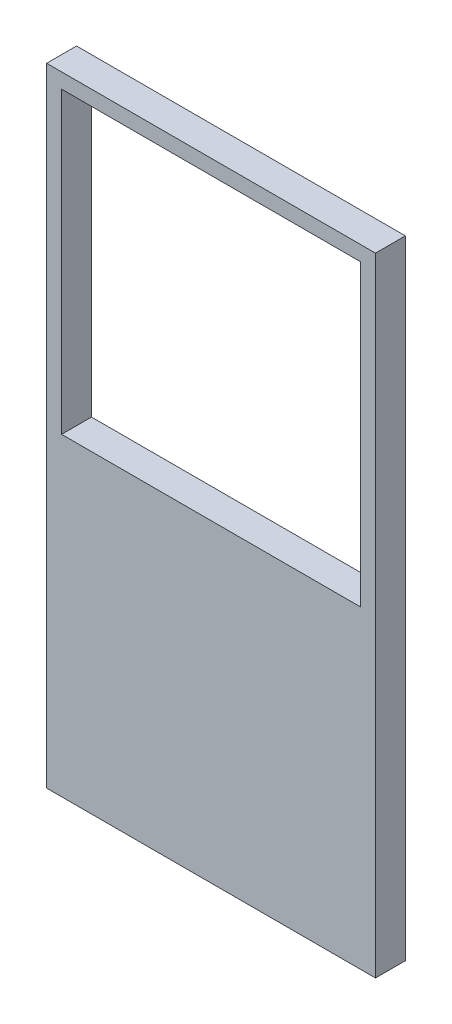
ISO-10303-21;
HEADER;
FILE_DESCRIPTION(('STEP AP214'),'2;1');
FILE_NAME('part.step','',(''),(''),'','','');
FILE_SCHEMA(('AUTOMOTIVE_DESIGN { 1 0 10303 214 1 1 1 1 }'));
ENDSEC;
DATA;
#1=APPLICATION_CONTEXT('core data for automotive mechanical design processes');
#2=APPLICATION_PROTOCOL_DEFINITION('international standard','automotive_design',2000,#1);
#3=PRODUCT_CONTEXT('',#1,'mechanical');
#4=PRODUCT('Part','Part','',(#3));
#5=PRODUCT_RELATED_PRODUCT_CATEGORY('part','',(#4));
#6=PRODUCT_DEFINITION_FORMATION('','',#4);
#7=PRODUCT_DEFINITION_CONTEXT('part definition',#1,'design');
#8=PRODUCT_DEFINITION('design','',#6,#7);
#9=PRODUCT_DEFINITION_SHAPE('','',#8);
#10=(LENGTH_UNIT() NAMED_UNIT(*) SI_UNIT(.MILLI.,.METRE.));
#11=(NAMED_UNIT(*) PLANE_ANGLE_UNIT() SI_UNIT($,.RADIAN.));
#12=(NAMED_UNIT(*) SI_UNIT($,.STERADIAN.) SOLID_ANGLE_UNIT());
#13=UNCERTAINTY_MEASURE_WITH_UNIT(LENGTH_MEASURE(1.E-05),#10,'distance_accuracy_value','');
#14=(GEOMETRIC_REPRESENTATION_CONTEXT(3) GLOBAL_UNCERTAINTY_ASSIGNED_CONTEXT((#13)) GLOBAL_UNIT_ASSIGNED_CONTEXT((#10,
#11,#12)) REPRESENTATION_CONTEXT('',''));
#15=CARTESIAN_POINT('',(0.,0.,0.));
#16=DIRECTION('',(0.,0.,1.));
#17=DIRECTION('',(1.,0.,0.));
#18=AXIS2_PLACEMENT_3D('',#15,#16,#17);
#19=CARTESIAN_POINT('',(0.,0.,1.27));
#20=DIRECTION('',(0.,0.,1.));
#21=DIRECTION('',(1.,0.,0.));
#22=AXIS2_PLACEMENT_3D('',#19,#20,#21);
#23=PLANE('',#22);
#24=DIRECTION('',(0.,-1.,0.));
#25=VECTOR('',#24,1.);
#26=CARTESIAN_POINT('',(-13.97,0.,1.27));
#27=LINE('',#26,#25);
#28=CARTESIAN_POINT('',(-13.97,13.97,1.27));
#29=VERTEX_POINT('',#28);
#30=CARTESIAN_POINT('',(-13.97,-39.37,1.27));
#31=VERTEX_POINT('',#30);
#32=EDGE_CURVE('E176',#29,#31,#27,.T.);
#33=ORIENTED_EDGE('',*,*,#32,.T.);
#34=DIRECTION('',(1.,0.,0.));
#35=VECTOR('',#34,1.);
#36=CARTESIAN_POINT('',(-13.97,-39.37,1.27));
#37=LINE('',#36,#35);
#38=CARTESIAN_POINT('',(13.97,-39.37,1.27));
#39=VERTEX_POINT('',#38);
#40=EDGE_CURVE('E142',#31,#39,#37,.T.);
#41=ORIENTED_EDGE('',*,*,#40,.T.);
#42=DIRECTION('',(0.,1.,0.));
#43=VECTOR('',#42,1.);
#44=CARTESIAN_POINT('',(13.97,0.,1.27));
#45=LINE('',#44,#43);
#46=CARTESIAN_POINT('',(13.97,13.97,1.27));
#47=VERTEX_POINT('',#46);
#48=EDGE_CURVE('E178',#39,#47,#45,.T.);
#49=ORIENTED_EDGE('',*,*,#48,.T.);
#50=DIRECTION('',(-1.,0.,0.));
#51=VECTOR('',#50,1.);
#52=CARTESIAN_POINT('',(0.,13.97,1.27));
#53=LINE('',#52,#51);
#54=EDGE_CURVE('E181',#47,#29,#53,.T.);
#55=ORIENTED_EDGE('',*,*,#54,.T.);
#56=EDGE_LOOP('',(#33,#41,#49,#55));
#57=FACE_BOUND('',#56,.T.);
#58=DIRECTION('',(1.,0.,0.));
#59=VECTOR('',#58,1.);
#60=CARTESIAN_POINT('',(12.7,-12.7,1.27));
#61=LINE('',#60,#59);
#62=CARTESIAN_POINT('',(-12.7,-12.7,1.27));
#63=VERTEX_POINT('',#62);
#64=CARTESIAN_POINT('',(12.7,-12.7,1.27));
#65=VERTEX_POINT('',#64);
#66=EDGE_CURVE('E154',#63,#65,#61,.T.);
#67=ORIENTED_EDGE('',*,*,#66,.F.);
#68=DIRECTION('',(0.,-1.,0.));
#69=VECTOR('',#68,1.);
#70=CARTESIAN_POINT('',(-12.7,12.7,1.27));
#71=LINE('',#70,#69);
#72=CARTESIAN_POINT('',(-12.7,12.7,1.27));
#73=VERTEX_POINT('',#72);
#74=EDGE_CURVE('E152',#73,#63,#71,.T.);
#75=ORIENTED_EDGE('',*,*,#74,.F.);
#76=DIRECTION('',(-1.,0.,0.));
#77=VECTOR('',#76,1.);
#78=CARTESIAN_POINT('',(12.7,12.7,1.27));
#79=LINE('',#78,#77);
#80=CARTESIAN_POINT('',(12.7,12.7,1.27));
#81=VERTEX_POINT('',#80);
#82=EDGE_CURVE('E159',#81,#73,#79,.T.);
#83=ORIENTED_EDGE('',*,*,#82,.F.);
#84=DIRECTION('',(0.,1.,0.));
#85=VECTOR('',#84,1.);
#86=CARTESIAN_POINT('',(12.7,12.7,1.27));
#87=LINE('',#86,#85);
#88=EDGE_CURVE('E157',#65,#81,#87,.T.);
#89=ORIENTED_EDGE('',*,*,#88,.F.);
#90=EDGE_LOOP('',(#67,#75,#83,#89));
#91=FACE_BOUND('',#90,.T.);
#92=ADVANCED_FACE('F56',(#57,#91),#23,.T.);
#93=CARTESIAN_POINT('',(0.,0.,-1.27));
#94=DIRECTION('',(0.,0.,1.));
#95=DIRECTION('',(1.,0.,0.));
#96=AXIS2_PLACEMENT_3D('',#93,#94,#95);
#97=PLANE('',#96);
#98=DIRECTION('',(0.,-1.,0.));
#99=VECTOR('',#98,1.);
#100=CARTESIAN_POINT('',(-13.97,0.,-1.27));
#101=LINE('',#100,#99);
#102=CARTESIAN_POINT('',(-13.97,13.97,-1.27));
#103=VERTEX_POINT('',#102);
#104=CARTESIAN_POINT('',(-13.97,-39.37,-1.27));
#105=VERTEX_POINT('',#104);
#106=EDGE_CURVE('E124',#103,#105,#101,.T.);
#107=ORIENTED_EDGE('',*,*,#106,.F.);
#108=DIRECTION('',(-1.,0.,0.));
#109=VECTOR('',#108,1.);
#110=CARTESIAN_POINT('',(0.,13.97,-1.27));
#111=LINE('',#110,#109);
#112=CARTESIAN_POINT('',(13.97,13.97,-1.27));
#113=VERTEX_POINT('',#112);
#114=EDGE_CURVE('E179',#113,#103,#111,.T.);
#115=ORIENTED_EDGE('',*,*,#114,.F.);
#116=DIRECTION('',(0.,1.,0.));
#117=VECTOR('',#116,1.);
#118=CARTESIAN_POINT('',(13.97,0.,-1.27));
#119=LINE('',#118,#117);
#120=CARTESIAN_POINT('',(13.97,-39.37,-1.27));
#121=VERTEX_POINT('',#120);
#122=EDGE_CURVE('E133',#121,#113,#119,.T.);
#123=ORIENTED_EDGE('',*,*,#122,.F.);
#124=DIRECTION('',(1.,0.,0.));
#125=VECTOR('',#124,1.);
#126=CARTESIAN_POINT('',(-13.97,-39.37,-1.27));
#127=LINE('',#126,#125);
#128=EDGE_CURVE('E140',#105,#121,#127,.T.);
#129=ORIENTED_EDGE('',*,*,#128,.F.);
#130=EDGE_LOOP('',(#107,#115,#123,#129));
#131=FACE_BOUND('',#130,.T.);
#132=DIRECTION('',(0.,-1.,0.));
#133=VECTOR('',#132,1.);
#134=CARTESIAN_POINT('',(-12.7,12.7,-1.27));
#135=LINE('',#134,#133);
#136=CARTESIAN_POINT('',(-12.7,12.7,-1.27));
#137=VERTEX_POINT('',#136);
#138=CARTESIAN_POINT('',(-12.7,-12.7,-1.27));
#139=VERTEX_POINT('',#138);
#140=EDGE_CURVE('E79',#137,#139,#135,.T.);
#141=ORIENTED_EDGE('',*,*,#140,.T.);
#142=DIRECTION('',(1.,0.,0.));
#143=VECTOR('',#142,1.);
#144=CARTESIAN_POINT('',(12.7,-12.7,-1.27));
#145=LINE('',#144,#143);
#146=CARTESIAN_POINT('',(12.7,-12.7,-1.27));
#147=VERTEX_POINT('',#146);
#148=EDGE_CURVE('E163',#139,#147,#145,.T.);
#149=ORIENTED_EDGE('',*,*,#148,.T.);
#150=DIRECTION('',(0.,1.,0.));
#151=VECTOR('',#150,1.);
#152=CARTESIAN_POINT('',(12.7,12.7,-1.27));
#153=LINE('',#152,#151);
#154=CARTESIAN_POINT('',(12.7,12.7,-1.27));
#155=VERTEX_POINT('',#154);
#156=EDGE_CURVE('E166',#147,#155,#153,.T.);
#157=ORIENTED_EDGE('',*,*,#156,.T.);
#158=DIRECTION('',(-1.,0.,0.));
#159=VECTOR('',#158,1.);
#160=CARTESIAN_POINT('',(12.7,12.7,-1.27));
#161=LINE('',#160,#159);
#162=EDGE_CURVE('E155',#155,#137,#161,.T.);
#163=ORIENTED_EDGE('',*,*,#162,.T.);
#164=EDGE_LOOP('',(#141,#149,#157,#163));
#165=FACE_BOUND('',#164,.T.);
#166=ADVANCED_FACE('F145',(#131,#165),#97,.F.);
#167=CARTESIAN_POINT('',(-13.97,0.,1.27));
#168=DIRECTION('',(1.,0.,0.));
#169=DIRECTION('',(0.,1.,0.));
#170=AXIS2_PLACEMENT_3D('',#167,#168,#169);
#171=PLANE('',#170);
#172=ORIENTED_EDGE('',*,*,#106,.T.);
#173=DIRECTION('',(0.,0.,1.));
#174=VECTOR('',#173,1.);
#175=CARTESIAN_POINT('',(-13.97,-39.37,-1.27));
#176=LINE('',#175,#174);
#177=EDGE_CURVE('E127',#105,#31,#176,.T.);
#178=ORIENTED_EDGE('',*,*,#177,.T.);
#179=ORIENTED_EDGE('',*,*,#32,.F.);
#180=DIRECTION('',(0.,0.,-1.));
#181=VECTOR('',#180,1.);
#182=CARTESIAN_POINT('',(-13.97,13.97,1.27));
#183=LINE('',#182,#181);
#184=EDGE_CURVE('E64',#29,#103,#183,.T.);
#185=ORIENTED_EDGE('',*,*,#184,.T.);
#186=EDGE_LOOP('',(#172,#178,#179,#185));
#187=FACE_BOUND('',#186,.T.);
#188=ADVANCED_FACE('F58',(#187),#171,.F.);
#189=CARTESIAN_POINT('',(13.97,0.,1.27));
#190=DIRECTION('',(-1.,0.,0.));
#191=DIRECTION('',(0.,-1.,0.));
#192=AXIS2_PLACEMENT_3D('',#189,#190,#191);
#193=PLANE('',#192);
#194=ORIENTED_EDGE('',*,*,#122,.T.);
#195=DIRECTION('',(0.,0.,-1.));
#196=VECTOR('',#195,1.);
#197=CARTESIAN_POINT('',(13.97,13.97,1.27));
#198=LINE('',#197,#196);
#199=EDGE_CURVE('E12',#47,#113,#198,.T.);
#200=ORIENTED_EDGE('',*,*,#199,.F.);
#201=ORIENTED_EDGE('',*,*,#48,.F.);
#202=DIRECTION('',(0.,0.,1.));
#203=VECTOR('',#202,1.);
#204=CARTESIAN_POINT('',(13.97,-39.37,-1.27));
#205=LINE('',#204,#203);
#206=EDGE_CURVE('E143',#121,#39,#205,.T.);
#207=ORIENTED_EDGE('',*,*,#206,.F.);
#208=EDGE_LOOP('',(#194,#200,#201,#207));
#209=FACE_BOUND('',#208,.T.);
#210=ADVANCED_FACE('F189',(#209),#193,.F.);
#211=CARTESIAN_POINT('',(0.,13.97,1.27));
#212=DIRECTION('',(0.,-1.,0.));
#213=DIRECTION('',(1.,0.,0.));
#214=AXIS2_PLACEMENT_3D('',#211,#212,#213);
#215=PLANE('',#214);
#216=ORIENTED_EDGE('',*,*,#114,.T.);
#217=ORIENTED_EDGE('',*,*,#184,.F.);
#218=ORIENTED_EDGE('',*,*,#54,.F.);
#219=ORIENTED_EDGE('',*,*,#199,.T.);
#220=EDGE_LOOP('',(#216,#217,#218,#219));
#221=FACE_BOUND('',#220,.T.);
#222=ADVANCED_FACE('F185',(#221),#215,.F.);
#223=CARTESIAN_POINT('',(-12.7,12.7,1.27));
#224=DIRECTION('',(1.,0.,0.));
#225=DIRECTION('',(0.,1.,0.));
#226=AXIS2_PLACEMENT_3D('',#223,#224,#225);
#227=PLANE('',#226);
#228=ORIENTED_EDGE('',*,*,#140,.F.);
#229=DIRECTION('',(0.,0.,-1.));
#230=VECTOR('',#229,1.);
#231=CARTESIAN_POINT('',(-12.7,12.7,1.27));
#232=LINE('',#231,#230);
#233=EDGE_CURVE('E161',#73,#137,#232,.T.);
#234=ORIENTED_EDGE('',*,*,#233,.F.);
#235=ORIENTED_EDGE('',*,*,#74,.T.);
#236=DIRECTION('',(0.,0.,-1.));
#237=VECTOR('',#236,1.);
#238=CARTESIAN_POINT('',(-12.7,-12.7,1.27));
#239=LINE('',#238,#237);
#240=EDGE_CURVE('E134',#63,#139,#239,.T.);
#241=ORIENTED_EDGE('',*,*,#240,.T.);
#242=EDGE_LOOP('',(#228,#234,#235,#241));
#243=FACE_BOUND('',#242,.T.);
#244=ADVANCED_FACE('F205',(#243),#227,.T.);
#245=CARTESIAN_POINT('',(12.7,-12.7,1.27));
#246=DIRECTION('',(0.,1.,0.));
#247=DIRECTION('',(-1.,0.,0.));
#248=AXIS2_PLACEMENT_3D('',#245,#246,#247);
#249=PLANE('',#248);
#250=ORIENTED_EDGE('',*,*,#148,.F.);
#251=ORIENTED_EDGE('',*,*,#240,.F.);
#252=ORIENTED_EDGE('',*,*,#66,.T.);
#253=DIRECTION('',(0.,0.,-1.));
#254=VECTOR('',#253,1.);
#255=CARTESIAN_POINT('',(12.7,-12.7,1.27));
#256=LINE('',#255,#254);
#257=EDGE_CURVE('E173',#65,#147,#256,.T.);
#258=ORIENTED_EDGE('',*,*,#257,.T.);
#259=EDGE_LOOP('',(#250,#251,#252,#258));
#260=FACE_BOUND('',#259,.T.);
#261=ADVANCED_FACE('F201',(#260),#249,.T.);
#262=CARTESIAN_POINT('',(12.7,12.7,1.27));
#263=DIRECTION('',(-1.,0.,0.));
#264=DIRECTION('',(0.,-1.,0.));
#265=AXIS2_PLACEMENT_3D('',#262,#263,#264);
#266=PLANE('',#265);
#267=ORIENTED_EDGE('',*,*,#156,.F.);
#268=ORIENTED_EDGE('',*,*,#257,.F.);
#269=ORIENTED_EDGE('',*,*,#88,.T.);
#270=DIRECTION('',(0.,0.,-1.));
#271=VECTOR('',#270,1.);
#272=CARTESIAN_POINT('',(12.7,12.7,1.27));
#273=LINE('',#272,#271);
#274=EDGE_CURVE('E71',#81,#155,#273,.T.);
#275=ORIENTED_EDGE('',*,*,#274,.T.);
#276=EDGE_LOOP('',(#267,#268,#269,#275));
#277=FACE_BOUND('',#276,.T.);
#278=ADVANCED_FACE('F204',(#277),#266,.T.);
#279=CARTESIAN_POINT('',(12.7,12.7,1.27));
#280=DIRECTION('',(0.,-1.,0.));
#281=DIRECTION('',(1.,0.,0.));
#282=AXIS2_PLACEMENT_3D('',#279,#280,#281);
#283=PLANE('',#282);
#284=ORIENTED_EDGE('',*,*,#162,.F.);
#285=ORIENTED_EDGE('',*,*,#274,.F.);
#286=ORIENTED_EDGE('',*,*,#82,.T.);
#287=ORIENTED_EDGE('',*,*,#233,.T.);
#288=EDGE_LOOP('',(#284,#285,#286,#287));
#289=FACE_BOUND('',#288,.T.);
#290=ADVANCED_FACE('F206',(#289),#283,.T.);
#291=CARTESIAN_POINT('',(-13.97,-39.37,-1.27));
#292=DIRECTION('',(0.,-1.,0.));
#293=DIRECTION('',(0.,0.,-1.));
#294=AXIS2_PLACEMENT_3D('',#291,#292,#293);
#295=PLANE('',#294);
#296=ORIENTED_EDGE('',*,*,#40,.F.);
#297=ORIENTED_EDGE('',*,*,#177,.F.);
#298=ORIENTED_EDGE('',*,*,#128,.T.);
#299=ORIENTED_EDGE('',*,*,#206,.T.);
#300=EDGE_LOOP('',(#296,#297,#298,#299));
#301=FACE_BOUND('',#300,.T.);
#302=ADVANCED_FACE('F138',(#301),#295,.T.);
#303=CLOSED_SHELL('',(#92,#166,#188,#210,#222,#244,#261,#278,#290,#302));
#304=MANIFOLD_SOLID_BREP('B2',#303);
#305=ADVANCED_BREP_SHAPE_REPRESENTATION('',(#18,#304),#14);
#306=SHAPE_DEFINITION_REPRESENTATION(#9,#305);
ENDSEC;
END-ISO-10303-21;
